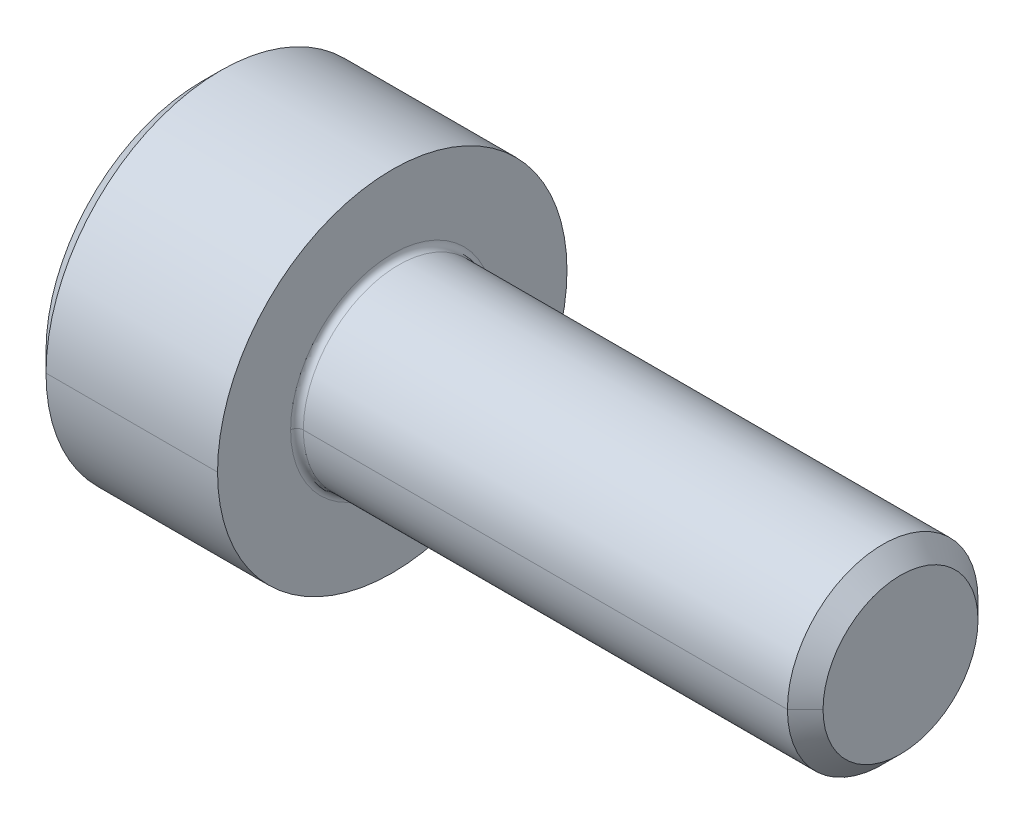
ISO-10303-21;
HEADER;
FILE_DESCRIPTION(('STEP AP214'),'2;1');
FILE_NAME('part.step','',(''),(''),'','','');
FILE_SCHEMA(('AUTOMOTIVE_DESIGN { 1 0 10303 214 1 1 1 1 }'));
ENDSEC;
DATA;
#1=APPLICATION_CONTEXT('core data for automotive mechanical design processes');
#2=APPLICATION_PROTOCOL_DEFINITION('international standard','automotive_design',2000,#1);
#3=PRODUCT_CONTEXT('',#1,'mechanical');
#4=PRODUCT('Part','Part','',(#3));
#5=PRODUCT_RELATED_PRODUCT_CATEGORY('part','',(#4));
#6=PRODUCT_DEFINITION_FORMATION('','',#4);
#7=PRODUCT_DEFINITION_CONTEXT('part definition',#1,'design');
#8=PRODUCT_DEFINITION('design','',#6,#7);
#9=PRODUCT_DEFINITION_SHAPE('','',#8);
#10=(LENGTH_UNIT() NAMED_UNIT(*) SI_UNIT(.MILLI.,.METRE.));
#11=(NAMED_UNIT(*) PLANE_ANGLE_UNIT() SI_UNIT($,.RADIAN.));
#12=(NAMED_UNIT(*) SI_UNIT($,.STERADIAN.) SOLID_ANGLE_UNIT());
#13=UNCERTAINTY_MEASURE_WITH_UNIT(LENGTH_MEASURE(1.E-05),#10,'distance_accuracy_value','');
#14=(GEOMETRIC_REPRESENTATION_CONTEXT(3) GLOBAL_UNCERTAINTY_ASSIGNED_CONTEXT((#13)) GLOBAL_UNIT_ASSIGNED_CONTEXT((#10,
#11,#12)) REPRESENTATION_CONTEXT('',''));
#15=CARTESIAN_POINT('',(0.,0.,0.));
#16=DIRECTION('',(0.,0.,1.));
#17=DIRECTION('',(1.,0.,0.));
#18=AXIS2_PLACEMENT_3D('',#15,#16,#17);
#19=CARTESIAN_POINT('',(1.3,0.,0.));
#20=DIRECTION('',(-1.,0.,0.));
#21=DIRECTION('',(0.,0.,1.));
#22=AXIS2_PLACEMENT_3D('',#19,#20,#21);
#23=CONICAL_SURFACE('',#22,1.28,1.0471975511966);
#24=DIRECTION('',(-0.5,0.,-0.866025403784438));
#25=VECTOR('',#24,1.);
#26=CARTESIAN_POINT('',(1.3,0.,-1.28));
#27=LINE('',#26,#25);
#28=CARTESIAN_POINT('',(2.03900834456273,0.,0.));
#29=VERTEX_POINT('',#28);
#30=CARTESIAN_POINT('',(1.3,0.,-1.28));
#31=VERTEX_POINT('',#30);
#32=EDGE_CURVE('E173',#29,#31,#27,.T.);
#33=ORIENTED_EDGE('',*,*,#32,.F.);
#34=DIRECTION('',(-0.5,0.,0.866025403784438));
#35=VECTOR('',#34,1.);
#36=CARTESIAN_POINT('',(1.3,0.,1.28));
#37=LINE('',#36,#35);
#38=CARTESIAN_POINT('',(1.3,0.,1.28));
#39=VERTEX_POINT('',#38);
#40=EDGE_CURVE('E374',#29,#39,#37,.T.);
#41=ORIENTED_EDGE('',*,*,#40,.T.);
#42=CARTESIAN_POINT('',(1.3,0.,0.));
#43=DIRECTION('',(-1.,0.,0.));
#44=DIRECTION('',(0.,0.,1.));
#45=AXIS2_PLACEMENT_3D('',#42,#43,#44);
#46=CIRCLE('',#45,1.28);
#47=CARTESIAN_POINT('',(1.3,1.10851251684408,0.64));
#48=VERTEX_POINT('',#47);
#49=EDGE_CURVE('E123',#39,#48,#46,.T.);
#50=ORIENTED_EDGE('',*,*,#49,.T.);
#51=CARTESIAN_POINT('',(1.3,0.,0.));
#52=DIRECTION('',(-1.,0.,0.));
#53=DIRECTION('',(0.,0.,1.));
#54=AXIS2_PLACEMENT_3D('',#51,#52,#53);
#55=CIRCLE('',#54,1.28);
#56=CARTESIAN_POINT('',(1.3,1.10851251684408,-0.64));
#57=VERTEX_POINT('',#56);
#58=EDGE_CURVE('E19',#48,#57,#55,.T.);
#59=ORIENTED_EDGE('',*,*,#58,.T.);
#60=CARTESIAN_POINT('',(1.3,0.,0.));
#61=DIRECTION('',(-1.,0.,0.));
#62=DIRECTION('',(0.,0.,1.));
#63=AXIS2_PLACEMENT_3D('',#60,#61,#62);
#64=CIRCLE('',#63,1.28);
#65=EDGE_CURVE('E11',#57,#31,#64,.T.);
#66=ORIENTED_EDGE('',*,*,#65,.T.);
#67=EDGE_LOOP('',(#33,#41,#50,#59,#66));
#68=FACE_BOUND('',#67,.T.);
#69=ADVANCED_FACE('F16',(#68),#23,.F.);
#70=CARTESIAN_POINT('',(1.3,2.21702503368815,-1.28));
#71=DIRECTION('',(1.,0.,0.));
#72=DIRECTION('',(0.,1.,0.));
#73=AXIS2_PLACEMENT_3D('',#70,#71,#72);
#74=PLANE('',#73);
#75=DIRECTION('',(0.,-0.5,-0.866025403784438));
#76=VECTOR('',#75,1.);
#77=CARTESIAN_POINT('',(1.3,1.47801668912544,0.));
#78=LINE('',#77,#76);
#79=CARTESIAN_POINT('',(1.3,0.739008344562715,-1.28));
#80=VERTEX_POINT('',#79);
#81=EDGE_CURVE('E120',#57,#80,#78,.T.);
#82=ORIENTED_EDGE('',*,*,#81,.T.);
#83=DIRECTION('',(0.,-1.,0.));
#84=VECTOR('',#83,1.);
#85=CARTESIAN_POINT('',(1.3,0.739008344562715,-1.28));
#86=LINE('',#85,#84);
#87=EDGE_CURVE('E87',#80,#31,#86,.T.);
#88=ORIENTED_EDGE('',*,*,#87,.T.);
#89=ORIENTED_EDGE('',*,*,#65,.F.);
#90=EDGE_LOOP('',(#82,#88,#89));
#91=FACE_BOUND('',#90,.T.);
#92=ADVANCED_FACE('F364',(#91),#74,.F.);
#93=CARTESIAN_POINT('',(1.3,2.21702503368815,-1.28));
#94=DIRECTION('',(1.,0.,0.));
#95=DIRECTION('',(0.,1.,0.));
#96=AXIS2_PLACEMENT_3D('',#93,#94,#95);
#97=PLANE('',#96);
#98=DIRECTION('',(0.,-0.5,0.86602540378444));
#99=VECTOR('',#98,1.);
#100=CARTESIAN_POINT('',(1.3,1.47801668912544,0.));
#101=LINE('',#100,#99);
#102=CARTESIAN_POINT('',(1.3,1.47801668912544,0.));
#103=VERTEX_POINT('',#102);
#104=EDGE_CURVE('E298',#103,#48,#101,.T.);
#105=ORIENTED_EDGE('',*,*,#104,.F.);
#106=DIRECTION('',(0.,-0.5,-0.866025403784438));
#107=VECTOR('',#106,1.);
#108=CARTESIAN_POINT('',(1.3,1.47801668912544,0.));
#109=LINE('',#108,#107);
#110=EDGE_CURVE('E122',#103,#57,#109,.T.);
#111=ORIENTED_EDGE('',*,*,#110,.T.);
#112=ORIENTED_EDGE('',*,*,#58,.F.);
#113=EDGE_LOOP('',(#105,#111,#112));
#114=FACE_BOUND('',#113,.T.);
#115=ADVANCED_FACE('F369',(#114),#97,.F.);
#116=CARTESIAN_POINT('',(1.3,2.21702503368815,-1.28));
#117=DIRECTION('',(1.,0.,0.));
#118=DIRECTION('',(0.,1.,0.));
#119=AXIS2_PLACEMENT_3D('',#116,#117,#118);
#120=PLANE('',#119);
#121=DIRECTION('',(0.,1.,0.));
#122=VECTOR('',#121,1.);
#123=CARTESIAN_POINT('',(1.3,-0.739008344562722,1.28));
#124=LINE('',#123,#122);
#125=CARTESIAN_POINT('',(1.3,0.739008344562719,1.28));
#126=VERTEX_POINT('',#125);
#127=EDGE_CURVE('E150',#39,#126,#124,.T.);
#128=ORIENTED_EDGE('',*,*,#127,.T.);
#129=DIRECTION('',(0.,-0.5,0.86602540378444));
#130=VECTOR('',#129,1.);
#131=CARTESIAN_POINT('',(1.3,1.47801668912544,0.));
#132=LINE('',#131,#130);
#133=EDGE_CURVE('E301',#48,#126,#132,.T.);
#134=ORIENTED_EDGE('',*,*,#133,.F.);
#135=ORIENTED_EDGE('',*,*,#49,.F.);
#136=EDGE_LOOP('',(#128,#134,#135));
#137=FACE_BOUND('',#136,.T.);
#138=ADVANCED_FACE('F614',(#137),#120,.F.);
#139=CARTESIAN_POINT('',(1.3,2.21702503368815,-1.28));
#140=DIRECTION('',(1.,0.,0.));
#141=DIRECTION('',(0.,1.,0.));
#142=AXIS2_PLACEMENT_3D('',#139,#140,#141);
#143=PLANE('',#142);
#144=DIRECTION('',(0.,-0.5,-0.866025403784438));
#145=VECTOR('',#144,1.);
#146=CARTESIAN_POINT('',(1.3,-0.739008344562722,1.28));
#147=LINE('',#146,#145);
#148=CARTESIAN_POINT('',(1.3,-0.739008344562722,1.28));
#149=VERTEX_POINT('',#148);
#150=CARTESIAN_POINT('',(1.3,-1.10851251684408,0.64));
#151=VERTEX_POINT('',#150);
#152=EDGE_CURVE('E153',#149,#151,#147,.T.);
#153=ORIENTED_EDGE('',*,*,#152,.F.);
#154=DIRECTION('',(0.,1.,0.));
#155=VECTOR('',#154,1.);
#156=CARTESIAN_POINT('',(1.3,-0.739008344562722,1.28));
#157=LINE('',#156,#155);
#158=EDGE_CURVE('E146',#149,#39,#157,.T.);
#159=ORIENTED_EDGE('',*,*,#158,.T.);
#160=CARTESIAN_POINT('',(1.3,0.,0.));
#161=DIRECTION('',(-1.,0.,0.));
#162=DIRECTION('',(0.,0.,1.));
#163=AXIS2_PLACEMENT_3D('',#160,#161,#162);
#164=CIRCLE('',#163,1.28);
#165=EDGE_CURVE('E181',#151,#39,#164,.T.);
#166=ORIENTED_EDGE('',*,*,#165,.F.);
#167=EDGE_LOOP('',(#153,#159,#166));
#168=FACE_BOUND('',#167,.T.);
#169=ADVANCED_FACE('F618',(#168),#143,.F.);
#170=CARTESIAN_POINT('',(1.3,2.21702503368815,-1.28));
#171=DIRECTION('',(1.,0.,0.));
#172=DIRECTION('',(0.,1.,0.));
#173=AXIS2_PLACEMENT_3D('',#170,#171,#172);
#174=PLANE('',#173);
#175=DIRECTION('',(0.,0.5,-0.86602540378444));
#176=VECTOR('',#175,1.);
#177=CARTESIAN_POINT('',(1.3,-1.47801668912544,0.));
#178=LINE('',#177,#176);
#179=CARTESIAN_POINT('',(1.3,-1.47801668912544,0.));
#180=VERTEX_POINT('',#179);
#181=CARTESIAN_POINT('',(1.3,-1.10851251684408,-0.64));
#182=VERTEX_POINT('',#181);
#183=EDGE_CURVE('E103',#180,#182,#178,.T.);
#184=ORIENTED_EDGE('',*,*,#183,.F.);
#185=DIRECTION('',(0.,-0.5,-0.866025403784438));
#186=VECTOR('',#185,1.);
#187=CARTESIAN_POINT('',(1.3,-0.739008344562722,1.28));
#188=LINE('',#187,#186);
#189=EDGE_CURVE('E114',#151,#180,#188,.T.);
#190=ORIENTED_EDGE('',*,*,#189,.F.);
#191=CARTESIAN_POINT('',(1.3,0.,0.));
#192=DIRECTION('',(-1.,0.,0.));
#193=DIRECTION('',(0.,0.,1.));
#194=AXIS2_PLACEMENT_3D('',#191,#192,#193);
#195=CIRCLE('',#194,1.28);
#196=EDGE_CURVE('E177',#182,#151,#195,.T.);
#197=ORIENTED_EDGE('',*,*,#196,.F.);
#198=EDGE_LOOP('',(#184,#190,#197));
#199=FACE_BOUND('',#198,.T.);
#200=ADVANCED_FACE('F626',(#199),#174,.F.);
#201=CARTESIAN_POINT('',(1.3,2.21702503368815,-1.28));
#202=DIRECTION('',(1.,0.,0.));
#203=DIRECTION('',(0.,1.,0.));
#204=AXIS2_PLACEMENT_3D('',#201,#202,#203);
#205=PLANE('',#204);
#206=DIRECTION('',(0.,-1.,0.));
#207=VECTOR('',#206,1.);
#208=CARTESIAN_POINT('',(1.3,0.739008344562715,-1.28));
#209=LINE('',#208,#207);
#210=CARTESIAN_POINT('',(1.3,-0.739008344562726,-1.28));
#211=VERTEX_POINT('',#210);
#212=EDGE_CURVE('E73',#31,#211,#209,.T.);
#213=ORIENTED_EDGE('',*,*,#212,.T.);
#214=DIRECTION('',(0.,0.5,-0.86602540378444));
#215=VECTOR('',#214,1.);
#216=CARTESIAN_POINT('',(1.3,-1.47801668912544,0.));
#217=LINE('',#216,#215);
#218=EDGE_CURVE('E78',#182,#211,#217,.T.);
#219=ORIENTED_EDGE('',*,*,#218,.F.);
#220=CARTESIAN_POINT('',(1.3,0.,0.));
#221=DIRECTION('',(-1.,0.,0.));
#222=DIRECTION('',(0.,0.,1.));
#223=AXIS2_PLACEMENT_3D('',#220,#221,#222);
#224=CIRCLE('',#223,1.28);
#225=EDGE_CURVE('E82',#31,#182,#224,.T.);
#226=ORIENTED_EDGE('',*,*,#225,.F.);
#227=EDGE_LOOP('',(#213,#219,#226));
#228=FACE_BOUND('',#227,.T.);
#229=ADVANCED_FACE('F75',(#228),#205,.F.);
#230=CARTESIAN_POINT('',(1.3,1.47801668912544,0.));
#231=DIRECTION('',(0.,0.866025403784438,-0.5));
#232=DIRECTION('',(-1.,0.,0.));
#233=AXIS2_PLACEMENT_3D('',#230,#231,#232);
#234=PLANE('',#233);
#235=DIRECTION('',(0.,-0.5,-0.866025403784438));
#236=VECTOR('',#235,1.);
#237=CARTESIAN_POINT('',(0.,1.47801668912544,0.));
#238=LINE('',#237,#236);
#239=CARTESIAN_POINT('',(0.,1.47801668912544,0.));
#240=VERTEX_POINT('',#239);
#241=CARTESIAN_POINT('',(0.,0.739008344562715,-1.28));
#242=VERTEX_POINT('',#241);
#243=EDGE_CURVE('E255',#240,#242,#238,.T.);
#244=ORIENTED_EDGE('',*,*,#243,.T.);
#245=DIRECTION('',(-1.,0.,0.));
#246=VECTOR('',#245,1.);
#247=CARTESIAN_POINT('',(1.3,0.739008344562715,-1.28));
#248=LINE('',#247,#246);
#249=EDGE_CURVE('E119',#80,#242,#248,.T.);
#250=ORIENTED_EDGE('',*,*,#249,.F.);
#251=ORIENTED_EDGE('',*,*,#81,.F.);
#252=ORIENTED_EDGE('',*,*,#110,.F.);
#253=DIRECTION('',(-1.,0.,0.));
#254=VECTOR('',#253,1.);
#255=CARTESIAN_POINT('',(1.3,1.47801668912544,0.));
#256=LINE('',#255,#254);
#257=EDGE_CURVE('E294',#103,#240,#256,.T.);
#258=ORIENTED_EDGE('',*,*,#257,.T.);
#259=EDGE_LOOP('',(#244,#250,#251,#252,#258));
#260=FACE_BOUND('',#259,.T.);
#261=ADVANCED_FACE('F640',(#260),#234,.F.);
#262=CARTESIAN_POINT('',(1.3,0.739008344562715,-1.28));
#263=DIRECTION('',(0.,0.,-1.));
#264=DIRECTION('',(0.,-1.,0.));
#265=AXIS2_PLACEMENT_3D('',#262,#263,#264);
#266=PLANE('',#265);
#267=DIRECTION('',(0.,-1.,0.));
#268=VECTOR('',#267,1.);
#269=CARTESIAN_POINT('',(0.,0.739008344562715,-1.28));
#270=LINE('',#269,#268);
#271=CARTESIAN_POINT('',(0.,-0.739008344562726,-1.28));
#272=VERTEX_POINT('',#271);
#273=EDGE_CURVE('E95',#242,#272,#270,.T.);
#274=ORIENTED_EDGE('',*,*,#273,.T.);
#275=DIRECTION('',(-1.,0.,0.));
#276=VECTOR('',#275,1.);
#277=CARTESIAN_POINT('',(1.3,-0.739008344562726,-1.28));
#278=LINE('',#277,#276);
#279=EDGE_CURVE('E88',#211,#272,#278,.T.);
#280=ORIENTED_EDGE('',*,*,#279,.F.);
#281=ORIENTED_EDGE('',*,*,#212,.F.);
#282=ORIENTED_EDGE('',*,*,#87,.F.);
#283=ORIENTED_EDGE('',*,*,#249,.T.);
#284=EDGE_LOOP('',(#274,#280,#281,#282,#283));
#285=FACE_BOUND('',#284,.T.);
#286=ADVANCED_FACE('F92',(#285),#266,.F.);
#287=CARTESIAN_POINT('',(1.3,-1.47801668912544,0.));
#288=DIRECTION('',(0.,0.86602540378444,0.5));
#289=DIRECTION('',(1.,0.,0.));
#290=AXIS2_PLACEMENT_3D('',#287,#288,#289);
#291=PLANE('',#290);
#292=DIRECTION('',(0.,0.5,-0.86602540378444));
#293=VECTOR('',#292,1.);
#294=CARTESIAN_POINT('',(0.,-1.47801668912544,0.));
#295=LINE('',#294,#293);
#296=CARTESIAN_POINT('',(0.,-1.47801668912544,0.));
#297=VERTEX_POINT('',#296);
#298=EDGE_CURVE('E274',#297,#272,#295,.T.);
#299=ORIENTED_EDGE('',*,*,#298,.F.);
#300=DIRECTION('',(-1.,0.,0.));
#301=VECTOR('',#300,1.);
#302=CARTESIAN_POINT('',(1.3,-1.47801668912544,0.));
#303=LINE('',#302,#301);
#304=EDGE_CURVE('E111',#180,#297,#303,.T.);
#305=ORIENTED_EDGE('',*,*,#304,.F.);
#306=ORIENTED_EDGE('',*,*,#183,.T.);
#307=ORIENTED_EDGE('',*,*,#218,.T.);
#308=ORIENTED_EDGE('',*,*,#279,.T.);
#309=EDGE_LOOP('',(#299,#305,#306,#307,#308));
#310=FACE_BOUND('',#309,.T.);
#311=ADVANCED_FACE('F101',(#310),#291,.T.);
#312=CARTESIAN_POINT('',(1.3,-0.739008344562722,1.28));
#313=DIRECTION('',(0.,0.866025403784438,-0.5));
#314=DIRECTION('',(-1.,0.,0.));
#315=AXIS2_PLACEMENT_3D('',#312,#313,#314);
#316=PLANE('',#315);
#317=DIRECTION('',(0.,-0.5,-0.866025403784438));
#318=VECTOR('',#317,1.);
#319=CARTESIAN_POINT('',(0.,-0.739008344562722,1.28));
#320=LINE('',#319,#318);
#321=CARTESIAN_POINT('',(0.,-0.739008344562722,1.28));
#322=VERTEX_POINT('',#321);
#323=EDGE_CURVE('E270',#322,#297,#320,.T.);
#324=ORIENTED_EDGE('',*,*,#323,.F.);
#325=DIRECTION('',(-1.,0.,0.));
#326=VECTOR('',#325,1.);
#327=CARTESIAN_POINT('',(1.3,-0.739008344562722,1.28));
#328=LINE('',#327,#326);
#329=EDGE_CURVE('E149',#149,#322,#328,.T.);
#330=ORIENTED_EDGE('',*,*,#329,.F.);
#331=ORIENTED_EDGE('',*,*,#152,.T.);
#332=ORIENTED_EDGE('',*,*,#189,.T.);
#333=ORIENTED_EDGE('',*,*,#304,.T.);
#334=EDGE_LOOP('',(#324,#330,#331,#332,#333));
#335=FACE_BOUND('',#334,.T.);
#336=ADVANCED_FACE('F652',(#335),#316,.T.);
#337=CARTESIAN_POINT('',(1.3,-0.739008344562722,1.28));
#338=DIRECTION('',(0.,0.,1.));
#339=DIRECTION('',(0.,-1.,0.));
#340=AXIS2_PLACEMENT_3D('',#337,#338,#339);
#341=PLANE('',#340);
#342=DIRECTION('',(0.,1.,0.));
#343=VECTOR('',#342,1.);
#344=CARTESIAN_POINT('',(0.,-0.739008344562722,1.28));
#345=LINE('',#344,#343);
#346=CARTESIAN_POINT('',(0.,0.739008344562719,1.28));
#347=VERTEX_POINT('',#346);
#348=EDGE_CURVE('E267',#322,#347,#345,.T.);
#349=ORIENTED_EDGE('',*,*,#348,.T.);
#350=DIRECTION('',(-1.,0.,0.));
#351=VECTOR('',#350,1.);
#352=CARTESIAN_POINT('',(1.3,0.739008344562719,1.28));
#353=LINE('',#352,#351);
#354=EDGE_CURVE('E144',#126,#347,#353,.T.);
#355=ORIENTED_EDGE('',*,*,#354,.F.);
#356=ORIENTED_EDGE('',*,*,#127,.F.);
#357=ORIENTED_EDGE('',*,*,#158,.F.);
#358=ORIENTED_EDGE('',*,*,#329,.T.);
#359=EDGE_LOOP('',(#349,#355,#356,#357,#358));
#360=FACE_BOUND('',#359,.T.);
#361=ADVANCED_FACE('F660',(#360),#341,.F.);
#362=CARTESIAN_POINT('',(1.3,1.47801668912544,0.));
#363=DIRECTION('',(0.,-0.86602540378444,-0.5));
#364=DIRECTION('',(0.,0.5,-0.86602540378444));
#365=AXIS2_PLACEMENT_3D('',#362,#363,#364);
#366=PLANE('',#365);
#367=DIRECTION('',(0.,-0.5,0.86602540378444));
#368=VECTOR('',#367,1.);
#369=CARTESIAN_POINT('',(0.,1.47801668912544,0.));
#370=LINE('',#369,#368);
#371=EDGE_CURVE('E263',#240,#347,#370,.T.);
#372=ORIENTED_EDGE('',*,*,#371,.F.);
#373=ORIENTED_EDGE('',*,*,#257,.F.);
#374=ORIENTED_EDGE('',*,*,#104,.T.);
#375=ORIENTED_EDGE('',*,*,#133,.T.);
#376=ORIENTED_EDGE('',*,*,#354,.T.);
#377=EDGE_LOOP('',(#372,#373,#374,#375,#376));
#378=FACE_BOUND('',#377,.T.);
#379=ADVANCED_FACE('F358',(#378),#366,.T.);
#380=CARTESIAN_POINT('',(3.1,0.,0.));
#381=DIRECTION('',(1.,0.,0.));
#382=DIRECTION('',(0.,0.,-1.));
#383=AXIS2_PLACEMENT_3D('',#380,#381,#382);
#384=TOROIDAL_SURFACE('',#383,1.6,0.1);
#385=CARTESIAN_POINT('',(3.1,0.,1.6));
#386=DIRECTION('',(0.,1.,0.));
#387=DIRECTION('',(0.,0.,1.));
#388=AXIS2_PLACEMENT_3D('',#385,#386,#387);
#389=CIRCLE('',#388,0.1);
#390=CARTESIAN_POINT('',(3.1,0.,1.5));
#391=VERTEX_POINT('',#390);
#392=CARTESIAN_POINT('',(3.,0.,1.6));
#393=VERTEX_POINT('',#392);
#394=EDGE_CURVE('E195',#391,#393,#389,.T.);
#395=ORIENTED_EDGE('',*,*,#394,.F.);
#396=CARTESIAN_POINT('',(3.1,0.,0.));
#397=DIRECTION('',(1.,0.,0.));
#398=DIRECTION('',(0.,0.,-1.));
#399=AXIS2_PLACEMENT_3D('',#396,#397,#398);
#400=CIRCLE('',#399,1.5);
#401=CARTESIAN_POINT('',(3.1,0.,-1.5));
#402=VERTEX_POINT('',#401);
#403=EDGE_CURVE('E208',#402,#391,#400,.T.);
#404=ORIENTED_EDGE('',*,*,#403,.F.);
#405=CARTESIAN_POINT('',(3.1,0.,-1.6));
#406=DIRECTION('',(0.,-1.,0.));
#407=DIRECTION('',(0.,0.,-1.));
#408=AXIS2_PLACEMENT_3D('',#405,#406,#407);
#409=CIRCLE('',#408,0.1);
#410=CARTESIAN_POINT('',(3.,0.,-1.6));
#411=VERTEX_POINT('',#410);
#412=EDGE_CURVE('E191',#402,#411,#409,.T.);
#413=ORIENTED_EDGE('',*,*,#412,.T.);
#414=CARTESIAN_POINT('',(3.,0.,0.));
#415=DIRECTION('',(-1.,0.,0.));
#416=DIRECTION('',(0.,0.,-1.));
#417=AXIS2_PLACEMENT_3D('',#414,#415,#416);
#418=CIRCLE('',#417,1.6);
#419=EDGE_CURVE('E285',#393,#411,#418,.T.);
#420=ORIENTED_EDGE('',*,*,#419,.F.);
#421=EDGE_LOOP('',(#395,#404,#413,#420));
#422=FACE_BOUND('',#421,.T.);
#423=ADVANCED_FACE('F348',(#422),#384,.F.);
#424=CARTESIAN_POINT('',(11.,1.2195,0.));
#425=DIRECTION('',(1.,0.,0.));
#426=DIRECTION('',(0.,1.,0.));
#427=AXIS2_PLACEMENT_3D('',#424,#425,#426);
#428=PLANE('',#427);
#429=CARTESIAN_POINT('',(11.,0.,0.));
#430=DIRECTION('',(-1.,0.,0.));
#431=DIRECTION('',(0.,0.,1.));
#432=AXIS2_PLACEMENT_3D('',#429,#430,#431);
#433=CIRCLE('',#432,1.2195);
#434=CARTESIAN_POINT('',(11.,0.,1.2195));
#435=VERTEX_POINT('',#434);
#436=CARTESIAN_POINT('',(11.,0.,-1.2195));
#437=VERTEX_POINT('',#436);
#438=EDGE_CURVE('E186',#435,#437,#433,.T.);
#439=ORIENTED_EDGE('',*,*,#438,.F.);
#440=CARTESIAN_POINT('',(11.,0.,0.));
#441=DIRECTION('',(-1.,0.,0.));
#442=DIRECTION('',(0.,0.,1.));
#443=AXIS2_PLACEMENT_3D('',#440,#441,#442);
#444=CIRCLE('',#443,1.2195);
#445=EDGE_CURVE('E293',#437,#435,#444,.T.);
#446=ORIENTED_EDGE('',*,*,#445,.F.);
#447=EDGE_LOOP('',(#439,#446));
#448=FACE_BOUND('',#447,.T.);
#449=ADVANCED_FACE('F346',(#448),#428,.T.);
#450=CARTESIAN_POINT('',(11.,0.,0.));
#451=DIRECTION('',(-1.,0.,0.));
#452=DIRECTION('',(0.,0.,1.));
#453=AXIS2_PLACEMENT_3D('',#450,#451,#452);
#454=CONICAL_SURFACE('',#453,1.2195,0.785398163397391);
#455=DIRECTION('',(-0.707106781186588,0.,-0.707106781186507));
#456=VECTOR('',#455,1.);
#457=CARTESIAN_POINT('',(11.,0.,-1.2195));
#458=LINE('',#457,#456);
#459=CARTESIAN_POINT('',(10.7195,0.,-1.49999999999998));
#460=VERTEX_POINT('',#459);
#461=EDGE_CURVE('E190',#437,#460,#458,.T.);
#462=ORIENTED_EDGE('',*,*,#461,.F.);
#463=ORIENTED_EDGE('',*,*,#445,.T.);
#464=DIRECTION('',(-0.707106781186588,0.,0.707106781186507));
#465=VECTOR('',#464,1.);
#466=CARTESIAN_POINT('',(11.,0.,1.2195));
#467=LINE('',#466,#465);
#468=CARTESIAN_POINT('',(10.7195,0.,1.49999999999998));
#469=VERTEX_POINT('',#468);
#470=EDGE_CURVE('E215',#435,#469,#467,.T.);
#471=ORIENTED_EDGE('',*,*,#470,.T.);
#472=CARTESIAN_POINT('',(10.7195,0.,0.));
#473=DIRECTION('',(-1.,0.,0.));
#474=DIRECTION('',(0.,0.,1.));
#475=AXIS2_PLACEMENT_3D('',#472,#473,#474);
#476=CIRCLE('',#475,1.49999999999998);
#477=EDGE_CURVE('E289',#460,#469,#476,.T.);
#478=ORIENTED_EDGE('',*,*,#477,.F.);
#479=EDGE_LOOP('',(#462,#463,#471,#478));
#480=FACE_BOUND('',#479,.T.);
#481=ADVANCED_FACE('F334',(#480),#454,.T.);
#482=CARTESIAN_POINT('',(-31.75,0.,0.));
#483=DIRECTION('',(-1.,0.,0.));
#484=DIRECTION('',(0.,0.,1.));
#485=AXIS2_PLACEMENT_3D('',#482,#483,#484);
#486=CYLINDRICAL_SURFACE('',#485,1.5);
#487=DIRECTION('',(-1.,0.,0.));
#488=VECTOR('',#487,1.);
#489=CARTESIAN_POINT('',(-31.75,0.,-1.5));
#490=LINE('',#489,#488);
#491=EDGE_CURVE('E219',#460,#402,#490,.T.);
#492=ORIENTED_EDGE('',*,*,#491,.F.);
#493=ORIENTED_EDGE('',*,*,#477,.T.);
#494=DIRECTION('',(-1.,0.,0.));
#495=VECTOR('',#494,1.);
#496=CARTESIAN_POINT('',(-31.75,0.,1.5));
#497=LINE('',#496,#495);
#498=EDGE_CURVE('E203',#469,#391,#497,.T.);
#499=ORIENTED_EDGE('',*,*,#498,.T.);
#500=CARTESIAN_POINT('',(3.1,0.,0.));
#501=DIRECTION('',(1.,0.,0.));
#502=DIRECTION('',(0.,0.,-1.));
#503=AXIS2_PLACEMENT_3D('',#500,#501,#502);
#504=CIRCLE('',#503,1.5);
#505=EDGE_CURVE('E185',#391,#402,#504,.T.);
#506=ORIENTED_EDGE('',*,*,#505,.T.);
#507=EDGE_LOOP('',(#492,#493,#499,#506));
#508=FACE_BOUND('',#507,.T.);
#509=ADVANCED_FACE('F356',(#508),#486,.T.);
#510=CARTESIAN_POINT('',(3.,2.75,0.));
#511=DIRECTION('',(1.,0.,0.));
#512=DIRECTION('',(0.,1.,0.));
#513=AXIS2_PLACEMENT_3D('',#510,#511,#512);
#514=PLANE('',#513);
#515=CARTESIAN_POINT('',(3.,0.,0.));
#516=DIRECTION('',(-1.,0.,0.));
#517=DIRECTION('',(0.,0.,-1.));
#518=AXIS2_PLACEMENT_3D('',#515,#516,#517);
#519=CIRCLE('',#518,1.6);
#520=EDGE_CURVE('E196',#411,#393,#519,.T.);
#521=ORIENTED_EDGE('',*,*,#520,.T.);
#522=ORIENTED_EDGE('',*,*,#419,.T.);
#523=EDGE_LOOP('',(#521,#522));
#524=FACE_BOUND('',#523,.T.);
#525=CARTESIAN_POINT('',(3.,0.,0.));
#526=DIRECTION('',(-1.,0.,0.));
#527=DIRECTION('',(0.,0.,1.));
#528=AXIS2_PLACEMENT_3D('',#525,#526,#527);
#529=CIRCLE('',#528,2.75);
#530=CARTESIAN_POINT('',(3.,0.,2.75));
#531=VERTEX_POINT('',#530);
#532=CARTESIAN_POINT('',(3.,0.,-2.75));
#533=VERTEX_POINT('',#532);
#534=EDGE_CURVE('E207',#531,#533,#529,.T.);
#535=ORIENTED_EDGE('',*,*,#534,.F.);
#536=CARTESIAN_POINT('',(3.,0.,0.));
#537=DIRECTION('',(-1.,0.,0.));
#538=DIRECTION('',(0.,0.,1.));
#539=AXIS2_PLACEMENT_3D('',#536,#537,#538);
#540=CIRCLE('',#539,2.75);
#541=EDGE_CURVE('E254',#533,#531,#540,.T.);
#542=ORIENTED_EDGE('',*,*,#541,.F.);
#543=EDGE_LOOP('',(#535,#542));
#544=FACE_BOUND('',#543,.T.);
#545=ADVANCED_FACE('F687',(#524,#544),#514,.T.);
#546=CARTESIAN_POINT('',(-31.75,0.,0.));
#547=DIRECTION('',(-1.,0.,0.));
#548=DIRECTION('',(0.,0.,1.));
#549=AXIS2_PLACEMENT_3D('',#546,#547,#548);
#550=CYLINDRICAL_SURFACE('',#549,2.75);
#551=DIRECTION('',(-1.,0.,0.));
#552=VECTOR('',#551,1.);
#553=CARTESIAN_POINT('',(-31.75,0.,-2.75));
#554=LINE('',#553,#552);
#555=CARTESIAN_POINT('',(0.3,0.,-2.75));
#556=VERTEX_POINT('',#555);
#557=EDGE_CURVE('E238',#533,#556,#554,.T.);
#558=ORIENTED_EDGE('',*,*,#557,.F.);
#559=ORIENTED_EDGE('',*,*,#541,.T.);
#560=DIRECTION('',(-1.,0.,0.));
#561=VECTOR('',#560,1.);
#562=CARTESIAN_POINT('',(-31.75,0.,2.75));
#563=LINE('',#562,#561);
#564=CARTESIAN_POINT('',(0.3,0.,2.75));
#565=VERTEX_POINT('',#564);
#566=EDGE_CURVE('E228',#531,#565,#563,.T.);
#567=ORIENTED_EDGE('',*,*,#566,.T.);
#568=CARTESIAN_POINT('',(0.3,0.,0.));
#569=DIRECTION('',(-1.,0.,0.));
#570=DIRECTION('',(0.,0.,1.));
#571=AXIS2_PLACEMENT_3D('',#568,#569,#570);
#572=CIRCLE('',#571,2.75);
#573=EDGE_CURVE('E250',#556,#565,#572,.T.);
#574=ORIENTED_EDGE('',*,*,#573,.F.);
#575=EDGE_LOOP('',(#558,#559,#567,#574));
#576=FACE_BOUND('',#575,.T.);
#577=ADVANCED_FACE('F394',(#576),#550,.T.);
#578=CARTESIAN_POINT('',(0.,0.,0.));
#579=DIRECTION('',(1.,0.,0.));
#580=DIRECTION('',(0.,0.,-1.));
#581=AXIS2_PLACEMENT_3D('',#578,#579,#580);
#582=CONICAL_SURFACE('',#581,2.45,0.785398163397442);
#583=DIRECTION('',(0.707106781186552,0.,0.707106781186544));
#584=VECTOR('',#583,1.);
#585=CARTESIAN_POINT('',(0.,0.,2.45));
#586=LINE('',#585,#584);
#587=CARTESIAN_POINT('',(0.,0.,2.45));
#588=VERTEX_POINT('',#587);
#589=EDGE_CURVE('E227',#588,#565,#586,.T.);
#590=ORIENTED_EDGE('',*,*,#589,.F.);
#591=CARTESIAN_POINT('',(0.,0.,0.));
#592=DIRECTION('',(-1.,0.,0.));
#593=DIRECTION('',(0.,0.,1.));
#594=AXIS2_PLACEMENT_3D('',#591,#592,#593);
#595=CIRCLE('',#594,2.45);
#596=CARTESIAN_POINT('',(0.,0.,-2.45));
#597=VERTEX_POINT('',#596);
#598=EDGE_CURVE('E259',#597,#588,#595,.T.);
#599=ORIENTED_EDGE('',*,*,#598,.F.);
#600=DIRECTION('',(0.707106781186552,0.,-0.707106781186544));
#601=VECTOR('',#600,1.);
#602=CARTESIAN_POINT('',(0.,0.,-2.45));
#603=LINE('',#602,#601);
#604=EDGE_CURVE('E249',#597,#556,#603,.T.);
#605=ORIENTED_EDGE('',*,*,#604,.T.);
#606=ORIENTED_EDGE('',*,*,#573,.T.);
#607=EDGE_LOOP('',(#590,#599,#605,#606));
#608=FACE_BOUND('',#607,.T.);
#609=ADVANCED_FACE('F705',(#608),#582,.T.);
#610=CARTESIAN_POINT('',(0.,0.,0.));
#611=DIRECTION('',(-1.,0.,0.));
#612=DIRECTION('',(0.,0.,1.));
#613=AXIS2_PLACEMENT_3D('',#610,#611,#612);
#614=PLANE('',#613);
#615=ORIENTED_EDGE('',*,*,#371,.T.);
#616=ORIENTED_EDGE('',*,*,#348,.F.);
#617=ORIENTED_EDGE('',*,*,#323,.T.);
#618=ORIENTED_EDGE('',*,*,#298,.T.);
#619=ORIENTED_EDGE('',*,*,#273,.F.);
#620=ORIENTED_EDGE('',*,*,#243,.F.);
#621=EDGE_LOOP('',(#615,#616,#617,#618,#619,#620));
#622=FACE_BOUND('',#621,.T.);
#623=ORIENTED_EDGE('',*,*,#598,.T.);
#624=CARTESIAN_POINT('',(0.,0.,0.));
#625=DIRECTION('',(-1.,0.,0.));
#626=DIRECTION('',(0.,0.,1.));
#627=AXIS2_PLACEMENT_3D('',#624,#625,#626);
#628=CIRCLE('',#627,2.45);
#629=EDGE_CURVE('E223',#588,#597,#628,.T.);
#630=ORIENTED_EDGE('',*,*,#629,.T.);
#631=EDGE_LOOP('',(#623,#630));
#632=FACE_BOUND('',#631,.T.);
#633=ADVANCED_FACE('F713',(#622,#632),#614,.T.);
#634=CARTESIAN_POINT('',(0.,0.,0.));
#635=DIRECTION('',(1.,0.,0.));
#636=DIRECTION('',(0.,0.,-1.));
#637=AXIS2_PLACEMENT_3D('',#634,#635,#636);
#638=CONICAL_SURFACE('',#637,2.45,0.785398163397442);
#639=ORIENTED_EDGE('',*,*,#629,.F.);
#640=ORIENTED_EDGE('',*,*,#589,.T.);
#641=CARTESIAN_POINT('',(0.3,0.,0.));
#642=DIRECTION('',(-1.,0.,0.));
#643=DIRECTION('',(0.,0.,1.));
#644=AXIS2_PLACEMENT_3D('',#641,#642,#643);
#645=CIRCLE('',#644,2.75);
#646=EDGE_CURVE('E242',#565,#556,#645,.T.);
#647=ORIENTED_EDGE('',*,*,#646,.T.);
#648=ORIENTED_EDGE('',*,*,#604,.F.);
#649=EDGE_LOOP('',(#639,#640,#647,#648));
#650=FACE_BOUND('',#649,.T.);
#651=ADVANCED_FACE('F407',(#650),#638,.T.);
#652=CARTESIAN_POINT('',(-31.75,0.,0.));
#653=DIRECTION('',(-1.,0.,0.));
#654=DIRECTION('',(0.,0.,1.));
#655=AXIS2_PLACEMENT_3D('',#652,#653,#654);
#656=CYLINDRICAL_SURFACE('',#655,2.75);
#657=ORIENTED_EDGE('',*,*,#534,.T.);
#658=ORIENTED_EDGE('',*,*,#557,.T.);
#659=ORIENTED_EDGE('',*,*,#646,.F.);
#660=ORIENTED_EDGE('',*,*,#566,.F.);
#661=EDGE_LOOP('',(#657,#658,#659,#660));
#662=FACE_BOUND('',#661,.T.);
#663=ADVANCED_FACE('F403',(#662),#656,.T.);
#664=CARTESIAN_POINT('',(-31.75,0.,0.));
#665=DIRECTION('',(-1.,0.,0.));
#666=DIRECTION('',(0.,0.,1.));
#667=AXIS2_PLACEMENT_3D('',#664,#665,#666);
#668=CYLINDRICAL_SURFACE('',#667,1.5);
#669=CARTESIAN_POINT('',(10.7195,0.,0.));
#670=DIRECTION('',(-1.,0.,0.));
#671=DIRECTION('',(0.,0.,1.));
#672=AXIS2_PLACEMENT_3D('',#669,#670,#671);
#673=CIRCLE('',#672,1.49999999999998);
#674=EDGE_CURVE('E214',#469,#460,#673,.T.);
#675=ORIENTED_EDGE('',*,*,#674,.T.);
#676=ORIENTED_EDGE('',*,*,#491,.T.);
#677=ORIENTED_EDGE('',*,*,#403,.T.);
#678=ORIENTED_EDGE('',*,*,#498,.F.);
#679=EDGE_LOOP('',(#675,#676,#677,#678));
#680=FACE_BOUND('',#679,.T.);
#681=ADVANCED_FACE('F749',(#680),#668,.T.);
#682=CARTESIAN_POINT('',(11.,0.,0.));
#683=DIRECTION('',(-1.,0.,0.));
#684=DIRECTION('',(0.,0.,1.));
#685=AXIS2_PLACEMENT_3D('',#682,#683,#684);
#686=CONICAL_SURFACE('',#685,1.2195,0.785398163397391);
#687=ORIENTED_EDGE('',*,*,#438,.T.);
#688=ORIENTED_EDGE('',*,*,#461,.T.);
#689=ORIENTED_EDGE('',*,*,#674,.F.);
#690=ORIENTED_EDGE('',*,*,#470,.F.);
#691=EDGE_LOOP('',(#687,#688,#689,#690));
#692=FACE_BOUND('',#691,.T.);
#693=ADVANCED_FACE('F345',(#692),#686,.T.);
#694=CARTESIAN_POINT('',(3.1,0.,0.));
#695=DIRECTION('',(1.,0.,0.));
#696=DIRECTION('',(0.,0.,-1.));
#697=AXIS2_PLACEMENT_3D('',#694,#695,#696);
#698=TOROIDAL_SURFACE('',#697,1.6,0.1);
#699=ORIENTED_EDGE('',*,*,#505,.F.);
#700=ORIENTED_EDGE('',*,*,#394,.T.);
#701=ORIENTED_EDGE('',*,*,#520,.F.);
#702=ORIENTED_EDGE('',*,*,#412,.F.);
#703=EDGE_LOOP('',(#699,#700,#701,#702));
#704=FACE_BOUND('',#703,.T.);
#705=ADVANCED_FACE('F780',(#704),#698,.F.);
#706=CARTESIAN_POINT('',(1.3,0.,0.));
#707=DIRECTION('',(-1.,0.,0.));
#708=DIRECTION('',(0.,0.,1.));
#709=AXIS2_PLACEMENT_3D('',#706,#707,#708);
#710=CONICAL_SURFACE('',#709,1.28,1.0471975511966);
#711=ORIENTED_EDGE('',*,*,#40,.F.);
#712=ORIENTED_EDGE('',*,*,#32,.T.);
#713=ORIENTED_EDGE('',*,*,#225,.T.);
#714=ORIENTED_EDGE('',*,*,#196,.T.);
#715=ORIENTED_EDGE('',*,*,#165,.T.);
#716=EDGE_LOOP('',(#711,#712,#713,#714,#715));
#717=FACE_BOUND('',#716,.T.);
#718=ADVANCED_FACE('F379',(#717),#710,.F.);
#719=CLOSED_SHELL('',(#69,#92,#115,#138,#169,#200,#229,#261,#286,#311,#336,#361,#379,#423,#449,
#481,#509,#545,#577,#609,#633,#651,#663,#681,#693,#705,#718));
#720=MANIFOLD_SOLID_BREP('B1',#719);
#721=ADVANCED_BREP_SHAPE_REPRESENTATION('',(#18,#720),#14);
#722=SHAPE_DEFINITION_REPRESENTATION(#9,#721);
ENDSEC;
END-ISO-10303-21;
